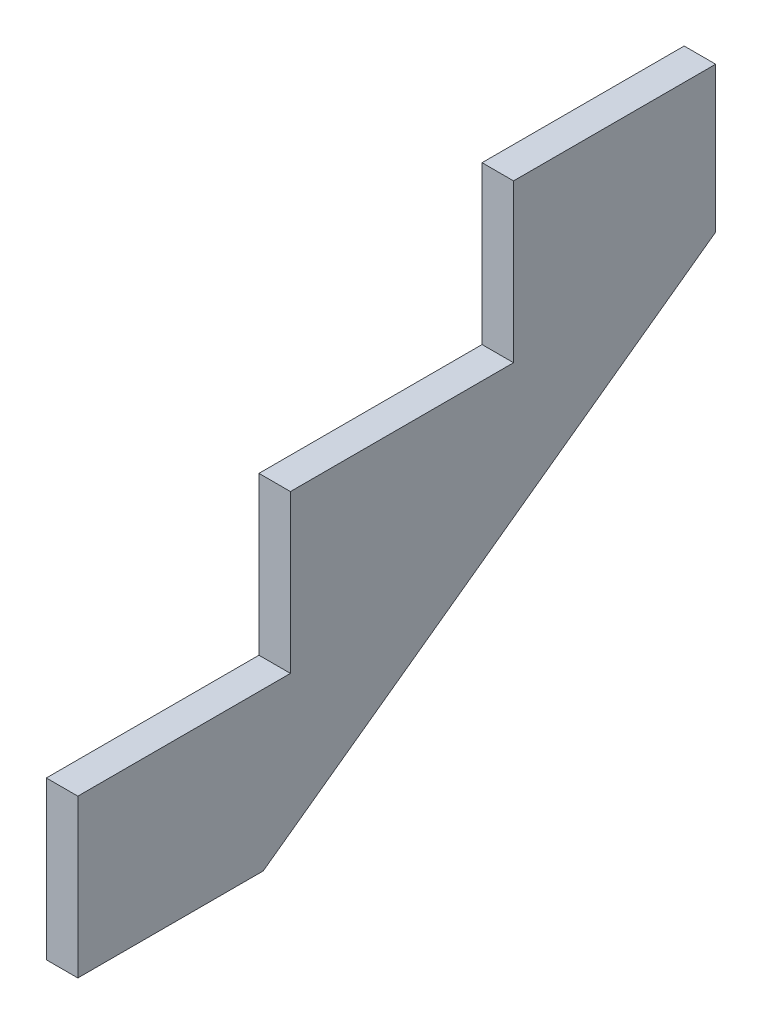
ISO-10303-21;
HEADER;
FILE_DESCRIPTION(('STEP AP214'),'2;1');
FILE_NAME('part.step','',(''),(''),'','','');
FILE_SCHEMA(('AUTOMOTIVE_DESIGN { 1 0 10303 214 1 1 1 1 }'));
ENDSEC;
DATA;
#1=APPLICATION_CONTEXT('core data for automotive mechanical design processes');
#2=APPLICATION_PROTOCOL_DEFINITION('international standard','automotive_design',2000,#1);
#3=PRODUCT_CONTEXT('',#1,'mechanical');
#4=PRODUCT('Part','Part','',(#3));
#5=PRODUCT_RELATED_PRODUCT_CATEGORY('part','',(#4));
#6=PRODUCT_DEFINITION_FORMATION('','',#4);
#7=PRODUCT_DEFINITION_CONTEXT('part definition',#1,'design');
#8=PRODUCT_DEFINITION('design','',#6,#7);
#9=PRODUCT_DEFINITION_SHAPE('','',#8);
#10=(LENGTH_UNIT() NAMED_UNIT(*) SI_UNIT(.MILLI.,.METRE.));
#11=(NAMED_UNIT(*) PLANE_ANGLE_UNIT() SI_UNIT($,.RADIAN.));
#12=(NAMED_UNIT(*) SI_UNIT($,.STERADIAN.) SOLID_ANGLE_UNIT());
#13=UNCERTAINTY_MEASURE_WITH_UNIT(LENGTH_MEASURE(1.E-05),#10,'distance_accuracy_value','');
#14=(GEOMETRIC_REPRESENTATION_CONTEXT(3) GLOBAL_UNCERTAINTY_ASSIGNED_CONTEXT((#13)) GLOBAL_UNIT_ASSIGNED_CONTEXT((#10,
#11,#12)) REPRESENTATION_CONTEXT('',''));
#15=CARTESIAN_POINT('',(0.,0.,0.));
#16=DIRECTION('',(0.,0.,1.));
#17=DIRECTION('',(1.,0.,0.));
#18=AXIS2_PLACEMENT_3D('',#15,#16,#17);
#19=CARTESIAN_POINT('',(38.1,0.,0.));
#20=DIRECTION('',(0.,0.,1.));
#21=DIRECTION('',(1.,0.,0.));
#22=AXIS2_PLACEMENT_3D('',#19,#20,#21);
#23=PLANE('',#22);
#24=DIRECTION('',(0.,1.,0.));
#25=VECTOR('',#24,1.);
#26=CARTESIAN_POINT('',(0.,0.,0.));
#27=LINE('',#26,#25);
#28=CARTESIAN_POINT('',(0.,0.,0.));
#29=VERTEX_POINT('',#28);
#30=CARTESIAN_POINT('',(0.,190.5,0.));
#31=VERTEX_POINT('',#30);
#32=EDGE_CURVE('E134',#29,#31,#27,.T.);
#33=ORIENTED_EDGE('',*,*,#32,.F.);
#34=DIRECTION('',(-1.,0.,0.));
#35=VECTOR('',#34,1.);
#36=CARTESIAN_POINT('',(38.1,0.,0.));
#37=LINE('',#36,#35);
#38=CARTESIAN_POINT('',(38.1,0.,0.));
#39=VERTEX_POINT('',#38);
#40=EDGE_CURVE('E11',#39,#29,#37,.T.);
#41=ORIENTED_EDGE('',*,*,#40,.F.);
#42=DIRECTION('',(0.,1.,0.));
#43=VECTOR('',#42,1.);
#44=CARTESIAN_POINT('',(38.1,0.,0.));
#45=LINE('',#44,#43);
#46=CARTESIAN_POINT('',(38.1,190.5,0.));
#47=VERTEX_POINT('',#46);
#48=EDGE_CURVE('E156',#39,#47,#45,.T.);
#49=ORIENTED_EDGE('',*,*,#48,.T.);
#50=DIRECTION('',(-1.,0.,0.));
#51=VECTOR('',#50,1.);
#52=CARTESIAN_POINT('',(38.1,190.5,0.));
#53=LINE('',#52,#51);
#54=EDGE_CURVE('E51',#47,#31,#53,.T.);
#55=ORIENTED_EDGE('',*,*,#54,.T.);
#56=EDGE_LOOP('',(#33,#41,#49,#55));
#57=FACE_BOUND('',#56,.T.);
#58=ADVANCED_FACE('F35',(#57),#23,.T.);
#59=CARTESIAN_POINT('',(38.1,0.,0.));
#60=DIRECTION('',(0.,1.,0.));
#61=DIRECTION('',(0.,0.,1.));
#62=AXIS2_PLACEMENT_3D('',#59,#60,#61);
#63=PLANE('',#62);
#64=DIRECTION('',(0.,0.,-1.));
#65=VECTOR('',#64,1.);
#66=CARTESIAN_POINT('',(0.,0.,0.));
#67=LINE('',#66,#65);
#68=CARTESIAN_POINT('',(0.,0.,-224.230338419017));
#69=VERTEX_POINT('',#68);
#70=EDGE_CURVE('E136',#29,#69,#67,.T.);
#71=ORIENTED_EDGE('',*,*,#70,.T.);
#72=DIRECTION('',(-1.,0.,0.));
#73=VECTOR('',#72,1.);
#74=CARTESIAN_POINT('',(38.1,0.,-224.230338419017));
#75=LINE('',#74,#73);
#76=CARTESIAN_POINT('',(38.1,0.,-224.230338419017));
#77=VERTEX_POINT('',#76);
#78=EDGE_CURVE('E43',#77,#69,#75,.T.);
#79=ORIENTED_EDGE('',*,*,#78,.F.);
#80=DIRECTION('',(0.,0.,-1.));
#81=VECTOR('',#80,1.);
#82=CARTESIAN_POINT('',(38.1,0.,0.));
#83=LINE('',#82,#81);
#84=EDGE_CURVE('E188',#39,#77,#83,.T.);
#85=ORIENTED_EDGE('',*,*,#84,.F.);
#86=ORIENTED_EDGE('',*,*,#40,.T.);
#87=EDGE_LOOP('',(#71,#79,#85,#86));
#88=FACE_BOUND('',#87,.T.);
#89=ADVANCED_FACE('F206',(#88),#63,.F.);
#90=CARTESIAN_POINT('',(38.1,-106.460776558938,-76.9595975124857));
#91=DIRECTION('',(0.,0.810421678379293,0.585846996418766));
#92=DIRECTION('',(0.,-0.585846996418766,0.810421678379293));
#93=AXIS2_PLACEMENT_3D('',#90,#91,#92);
#94=PLANE('',#93);
#95=DIRECTION('',(0.,0.585846996418766,-0.810421678379293));
#96=VECTOR('',#95,1.);
#97=CARTESIAN_POINT('',(0.,-106.460776558938,-76.9595975124857));
#98=LINE('',#97,#96);
#99=CARTESIAN_POINT('',(0.,395.634695118783,-771.525));
#100=VERTEX_POINT('',#99);
#101=EDGE_CURVE('E138',#69,#100,#98,.T.);
#102=ORIENTED_EDGE('',*,*,#101,.T.);
#103=DIRECTION('',(-1.,0.,0.));
#104=VECTOR('',#103,1.);
#105=CARTESIAN_POINT('',(38.1,395.634695118783,-771.525));
#106=LINE('',#105,#104);
#107=CARTESIAN_POINT('',(38.1,395.634695118783,-771.525));
#108=VERTEX_POINT('',#107);
#109=EDGE_CURVE('E164',#108,#100,#106,.T.);
#110=ORIENTED_EDGE('',*,*,#109,.F.);
#111=DIRECTION('',(0.,0.585846996418766,-0.810421678379293));
#112=VECTOR('',#111,1.);
#113=CARTESIAN_POINT('',(38.1,-106.460776558938,-76.9595975124857));
#114=LINE('',#113,#112);
#115=EDGE_CURVE('E172',#77,#108,#114,.T.);
#116=ORIENTED_EDGE('',*,*,#115,.F.);
#117=ORIENTED_EDGE('',*,*,#78,.T.);
#118=EDGE_LOOP('',(#102,#110,#116,#117));
#119=FACE_BOUND('',#118,.T.);
#120=ADVANCED_FACE('F170',(#119),#94,.F.);
#121=CARTESIAN_POINT('',(38.1,-4.87057307666492E-13,-771.525));
#122=DIRECTION('',(0.,0.,-1.));
#123=DIRECTION('',(0.,1.,0.));
#124=AXIS2_PLACEMENT_3D('',#121,#122,#123);
#125=PLANE('',#124);
#126=DIRECTION('',(0.,-1.,0.));
#127=VECTOR('',#126,1.);
#128=CARTESIAN_POINT('',(0.,-4.87057307666492E-13,-771.525));
#129=LINE('',#128,#127);
#130=CARTESIAN_POINT('',(0.,571.5,-771.525));
#131=VERTEX_POINT('',#130);
#132=EDGE_CURVE('E141',#131,#100,#129,.T.);
#133=ORIENTED_EDGE('',*,*,#132,.F.);
#134=DIRECTION('',(-1.,0.,0.));
#135=VECTOR('',#134,1.);
#136=CARTESIAN_POINT('',(38.1,571.5,-771.525));
#137=LINE('',#136,#135);
#138=CARTESIAN_POINT('',(38.1,571.5,-771.525));
#139=VERTEX_POINT('',#138);
#140=EDGE_CURVE('E162',#139,#131,#137,.T.);
#141=ORIENTED_EDGE('',*,*,#140,.F.);
#142=DIRECTION('',(0.,-1.,0.));
#143=VECTOR('',#142,1.);
#144=CARTESIAN_POINT('',(38.1,-4.87057307666492E-13,-771.525));
#145=LINE('',#144,#143);
#146=EDGE_CURVE('E184',#139,#108,#145,.T.);
#147=ORIENTED_EDGE('',*,*,#146,.T.);
#148=ORIENTED_EDGE('',*,*,#109,.T.);
#149=EDGE_LOOP('',(#133,#141,#147,#148));
#150=FACE_BOUND('',#149,.T.);
#151=ADVANCED_FACE('F180',(#150),#125,.T.);
#152=CARTESIAN_POINT('',(38.1,571.5,0.));
#153=DIRECTION('',(0.,-1.,0.));
#154=DIRECTION('',(0.,0.,-1.));
#155=AXIS2_PLACEMENT_3D('',#152,#153,#154);
#156=PLANE('',#155);
#157=DIRECTION('',(0.,0.,1.));
#158=VECTOR('',#157,1.);
#159=CARTESIAN_POINT('',(0.,571.5,0.));
#160=LINE('',#159,#158);
#161=CARTESIAN_POINT('',(0.,571.5,-527.05));
#162=VERTEX_POINT('',#161);
#163=EDGE_CURVE('E144',#131,#162,#160,.T.);
#164=ORIENTED_EDGE('',*,*,#163,.T.);
#165=DIRECTION('',(-1.,0.,0.));
#166=VECTOR('',#165,1.);
#167=CARTESIAN_POINT('',(38.1,571.5,-527.05));
#168=LINE('',#167,#166);
#169=CARTESIAN_POINT('',(38.1,571.5,-527.05));
#170=VERTEX_POINT('',#169);
#171=EDGE_CURVE('E160',#170,#162,#168,.T.);
#172=ORIENTED_EDGE('',*,*,#171,.F.);
#173=DIRECTION('',(0.,0.,1.));
#174=VECTOR('',#173,1.);
#175=CARTESIAN_POINT('',(38.1,571.5,0.));
#176=LINE('',#175,#174);
#177=EDGE_CURVE('E185',#139,#170,#176,.T.);
#178=ORIENTED_EDGE('',*,*,#177,.F.);
#179=ORIENTED_EDGE('',*,*,#140,.T.);
#180=EDGE_LOOP('',(#164,#172,#178,#179));
#181=FACE_BOUND('',#180,.T.);
#182=ADVANCED_FACE('F217',(#181),#156,.F.);
#183=CARTESIAN_POINT('',(38.1,-3.07161703479627E-13,-527.05));
#184=DIRECTION('',(0.,0.,1.));
#185=DIRECTION('',(0.,-1.,0.));
#186=AXIS2_PLACEMENT_3D('',#183,#184,#185);
#187=PLANE('',#186);
#188=DIRECTION('',(0.,1.,0.));
#189=VECTOR('',#188,1.);
#190=CARTESIAN_POINT('',(0.,-3.07161703479627E-13,-527.05));
#191=LINE('',#190,#189);
#192=CARTESIAN_POINT('',(0.,381.,-527.05));
#193=VERTEX_POINT('',#192);
#194=EDGE_CURVE('E147',#193,#162,#191,.T.);
#195=ORIENTED_EDGE('',*,*,#194,.F.);
#196=DIRECTION('',(-1.,0.,0.));
#197=VECTOR('',#196,1.);
#198=CARTESIAN_POINT('',(38.1,381.,-527.05));
#199=LINE('',#198,#197);
#200=CARTESIAN_POINT('',(38.1,381.,-527.05));
#201=VERTEX_POINT('',#200);
#202=EDGE_CURVE('E116',#201,#193,#199,.T.);
#203=ORIENTED_EDGE('',*,*,#202,.F.);
#204=DIRECTION('',(0.,1.,0.));
#205=VECTOR('',#204,1.);
#206=CARTESIAN_POINT('',(38.1,-3.07161703479627E-13,-527.05));
#207=LINE('',#206,#205);
#208=EDGE_CURVE('E126',#201,#170,#207,.T.);
#209=ORIENTED_EDGE('',*,*,#208,.T.);
#210=ORIENTED_EDGE('',*,*,#171,.T.);
#211=EDGE_LOOP('',(#195,#203,#209,#210));
#212=FACE_BOUND('',#211,.T.);
#213=ADVANCED_FACE('F193',(#212),#187,.T.);
#214=CARTESIAN_POINT('',(38.1,381.,0.));
#215=DIRECTION('',(0.,1.,0.));
#216=DIRECTION('',(0.,0.,1.));
#217=AXIS2_PLACEMENT_3D('',#214,#215,#216);
#218=PLANE('',#217);
#219=DIRECTION('',(0.,0.,-1.));
#220=VECTOR('',#219,1.);
#221=CARTESIAN_POINT('',(0.,381.,0.));
#222=LINE('',#221,#220);
#223=CARTESIAN_POINT('',(0.,381.,-257.175));
#224=VERTEX_POINT('',#223);
#225=EDGE_CURVE('E112',#224,#193,#222,.T.);
#226=ORIENTED_EDGE('',*,*,#225,.F.);
#227=DIRECTION('',(-1.,0.,0.));
#228=VECTOR('',#227,1.);
#229=CARTESIAN_POINT('',(38.1,381.,-257.175));
#230=LINE('',#229,#228);
#231=CARTESIAN_POINT('',(38.1,381.,-257.175));
#232=VERTEX_POINT('',#231);
#233=EDGE_CURVE('E107',#232,#224,#230,.T.);
#234=ORIENTED_EDGE('',*,*,#233,.F.);
#235=DIRECTION('',(0.,0.,-1.));
#236=VECTOR('',#235,1.);
#237=CARTESIAN_POINT('',(38.1,381.,0.));
#238=LINE('',#237,#236);
#239=EDGE_CURVE('E110',#232,#201,#238,.T.);
#240=ORIENTED_EDGE('',*,*,#239,.T.);
#241=ORIENTED_EDGE('',*,*,#202,.T.);
#242=EDGE_LOOP('',(#226,#234,#240,#241));
#243=FACE_BOUND('',#242,.T.);
#244=ADVANCED_FACE('F109',(#243),#218,.T.);
#245=CARTESIAN_POINT('',(38.1,0.,-257.175));
#246=DIRECTION('',(0.,0.,1.));
#247=DIRECTION('',(1.,0.,0.));
#248=AXIS2_PLACEMENT_3D('',#245,#246,#247);
#249=PLANE('',#248);
#250=DIRECTION('',(0.,1.,0.));
#251=VECTOR('',#250,1.);
#252=CARTESIAN_POINT('',(0.,0.,-257.175));
#253=LINE('',#252,#251);
#254=CARTESIAN_POINT('',(0.,190.5,-257.175));
#255=VERTEX_POINT('',#254);
#256=EDGE_CURVE('E151',#255,#224,#253,.T.);
#257=ORIENTED_EDGE('',*,*,#256,.F.);
#258=DIRECTION('',(-1.,0.,0.));
#259=VECTOR('',#258,1.);
#260=CARTESIAN_POINT('',(38.1,190.5,-257.175));
#261=LINE('',#260,#259);
#262=CARTESIAN_POINT('',(38.1,190.5,-257.175));
#263=VERTEX_POINT('',#262);
#264=EDGE_CURVE('E79',#263,#255,#261,.T.);
#265=ORIENTED_EDGE('',*,*,#264,.F.);
#266=DIRECTION('',(0.,1.,0.));
#267=VECTOR('',#266,1.);
#268=CARTESIAN_POINT('',(38.1,0.,-257.175));
#269=LINE('',#268,#267);
#270=EDGE_CURVE('E124',#263,#232,#269,.T.);
#271=ORIENTED_EDGE('',*,*,#270,.T.);
#272=ORIENTED_EDGE('',*,*,#233,.T.);
#273=EDGE_LOOP('',(#257,#265,#271,#272));
#274=FACE_BOUND('',#273,.T.);
#275=ADVANCED_FACE('F128',(#274),#249,.T.);
#276=CARTESIAN_POINT('',(38.1,190.5,0.));
#277=DIRECTION('',(0.,1.,0.));
#278=DIRECTION('',(0.,0.,1.));
#279=AXIS2_PLACEMENT_3D('',#276,#277,#278);
#280=PLANE('',#279);
#281=DIRECTION('',(0.,0.,-1.));
#282=VECTOR('',#281,1.);
#283=CARTESIAN_POINT('',(0.,190.5,0.));
#284=LINE('',#283,#282);
#285=EDGE_CURVE('E153',#31,#255,#284,.T.);
#286=ORIENTED_EDGE('',*,*,#285,.F.);
#287=ORIENTED_EDGE('',*,*,#54,.F.);
#288=DIRECTION('',(0.,0.,-1.));
#289=VECTOR('',#288,1.);
#290=CARTESIAN_POINT('',(38.1,190.5,0.));
#291=LINE('',#290,#289);
#292=EDGE_CURVE('E129',#47,#263,#291,.T.);
#293=ORIENTED_EDGE('',*,*,#292,.T.);
#294=ORIENTED_EDGE('',*,*,#264,.T.);
#295=EDGE_LOOP('',(#286,#287,#293,#294));
#296=FACE_BOUND('',#295,.T.);
#297=ADVANCED_FACE('F195',(#296),#280,.T.);
#298=CARTESIAN_POINT('',(38.1,0.,0.));
#299=DIRECTION('',(1.,0.,0.));
#300=DIRECTION('',(0.,0.,-1.));
#301=AXIS2_PLACEMENT_3D('',#298,#299,#300);
#302=PLANE('',#301);
#303=ORIENTED_EDGE('',*,*,#48,.F.);
#304=ORIENTED_EDGE('',*,*,#84,.T.);
#305=ORIENTED_EDGE('',*,*,#115,.T.);
#306=ORIENTED_EDGE('',*,*,#146,.F.);
#307=ORIENTED_EDGE('',*,*,#177,.T.);
#308=ORIENTED_EDGE('',*,*,#208,.F.);
#309=ORIENTED_EDGE('',*,*,#239,.F.);
#310=ORIENTED_EDGE('',*,*,#270,.F.);
#311=ORIENTED_EDGE('',*,*,#292,.F.);
#312=EDGE_LOOP('',(#303,#304,#305,#306,#307,#308,#309,#310,#311));
#313=FACE_BOUND('',#312,.T.);
#314=ADVANCED_FACE('F122',(#313),#302,.T.);
#315=CARTESIAN_POINT('',(0.,0.,0.));
#316=DIRECTION('',(1.,0.,0.));
#317=DIRECTION('',(0.,0.,-1.));
#318=AXIS2_PLACEMENT_3D('',#315,#316,#317);
#319=PLANE('',#318);
#320=ORIENTED_EDGE('',*,*,#32,.T.);
#321=ORIENTED_EDGE('',*,*,#285,.T.);
#322=ORIENTED_EDGE('',*,*,#256,.T.);
#323=ORIENTED_EDGE('',*,*,#225,.T.);
#324=ORIENTED_EDGE('',*,*,#194,.T.);
#325=ORIENTED_EDGE('',*,*,#163,.F.);
#326=ORIENTED_EDGE('',*,*,#132,.T.);
#327=ORIENTED_EDGE('',*,*,#101,.F.);
#328=ORIENTED_EDGE('',*,*,#70,.F.);
#329=EDGE_LOOP('',(#320,#321,#322,#323,#324,#325,#326,#327,#328));
#330=FACE_BOUND('',#329,.T.);
#331=ADVANCED_FACE('F176',(#330),#319,.F.);
#332=CLOSED_SHELL('',(#58,#89,#120,#151,#182,#213,#244,#275,#297,#314,#331));
#333=MANIFOLD_SOLID_BREP('B2',#332);
#334=ADVANCED_BREP_SHAPE_REPRESENTATION('',(#18,#333),#14);
#335=SHAPE_DEFINITION_REPRESENTATION(#9,#334);
ENDSEC;
END-ISO-10303-21;
